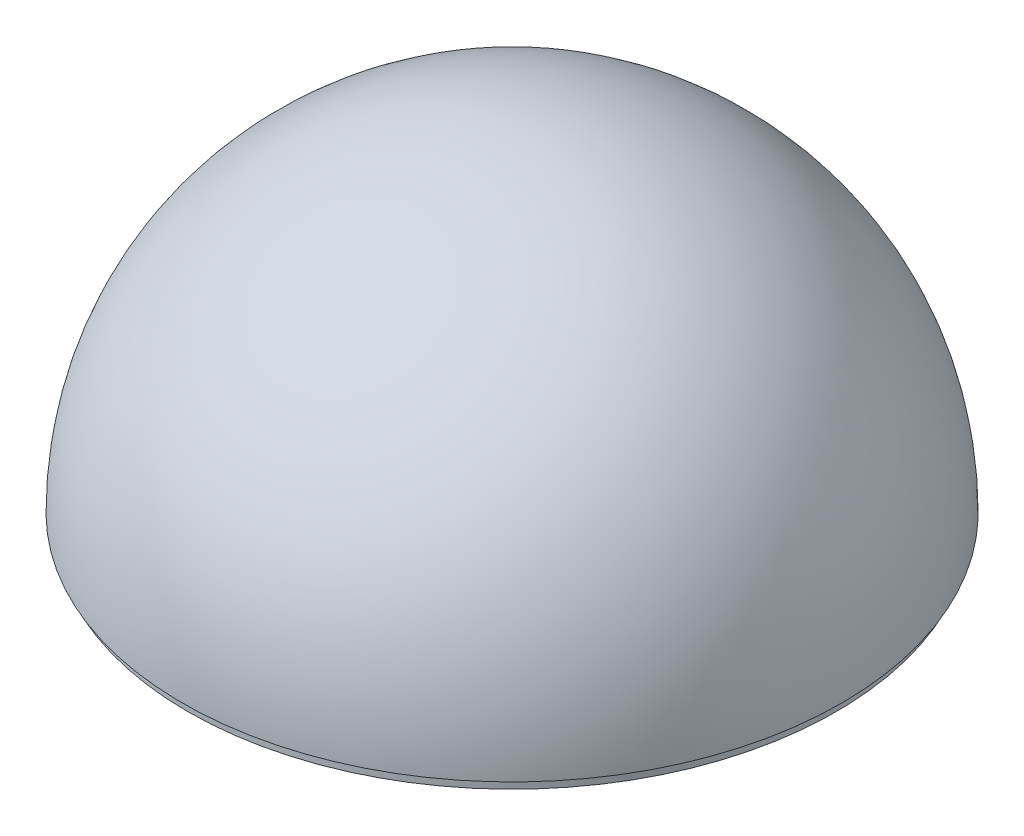
ISO-10303-21;
HEADER;
FILE_DESCRIPTION(('STEP AP214'),'2;1');
FILE_NAME('part.step','',(''),(''),'','','');
FILE_SCHEMA(('AUTOMOTIVE_DESIGN { 1 0 10303 214 1 1 1 1 }'));
ENDSEC;
DATA;
#1=APPLICATION_CONTEXT('core data for automotive mechanical design processes');
#2=APPLICATION_PROTOCOL_DEFINITION('international standard','automotive_design',2000,#1);
#3=PRODUCT_CONTEXT('',#1,'mechanical');
#4=PRODUCT('Part','Part','',(#3));
#5=PRODUCT_RELATED_PRODUCT_CATEGORY('part','',(#4));
#6=PRODUCT_DEFINITION_FORMATION('','',#4);
#7=PRODUCT_DEFINITION_CONTEXT('part definition',#1,'design');
#8=PRODUCT_DEFINITION('design','',#6,#7);
#9=PRODUCT_DEFINITION_SHAPE('','',#8);
#10=(LENGTH_UNIT() NAMED_UNIT(*) SI_UNIT(.MILLI.,.METRE.));
#11=(NAMED_UNIT(*) PLANE_ANGLE_UNIT() SI_UNIT($,.RADIAN.));
#12=(NAMED_UNIT(*) SI_UNIT($,.STERADIAN.) SOLID_ANGLE_UNIT());
#13=UNCERTAINTY_MEASURE_WITH_UNIT(LENGTH_MEASURE(1.E-05),#10,'distance_accuracy_value','');
#14=(GEOMETRIC_REPRESENTATION_CONTEXT(3) GLOBAL_UNCERTAINTY_ASSIGNED_CONTEXT((#13)) GLOBAL_UNIT_ASSIGNED_CONTEXT((#10,
#11,#12)) REPRESENTATION_CONTEXT('',''));
#15=CARTESIAN_POINT('',(0.,0.,0.));
#16=DIRECTION('',(0.,0.,1.));
#17=DIRECTION('',(1.,0.,0.));
#18=AXIS2_PLACEMENT_3D('',#15,#16,#17);
#19=CARTESIAN_POINT('',(0.,-4.7625,0.));
#20=DIRECTION('',(0.,1.,0.));
#21=DIRECTION('',(0.,0.,1.));
#22=AXIS2_PLACEMENT_3D('',#19,#20,#21);
#23=CYLINDRICAL_SURFACE('',#22,152.4);
#24=CARTESIAN_POINT('',(0.,-4.7625,0.));
#25=DIRECTION('',(0.,1.,0.));
#26=DIRECTION('',(0.,0.,1.));
#27=AXIS2_PLACEMENT_3D('',#24,#25,#26);
#28=CIRCLE('',#27,152.4);
#29=CARTESIAN_POINT('',(0.,-4.7625,152.4));
#30=VERTEX_POINT('',#29);
#31=EDGE_CURVE('E11',#30,#30,#28,.T.);
#32=CARTESIAN_POINT('',(0.,0.,0.));
#33=DIRECTION('',(0.,1.,0.));
#34=DIRECTION('',(0.,0.,1.));
#35=AXIS2_PLACEMENT_3D('',#32,#33,#34);
#36=CIRCLE('',#35,152.4);
#37=CARTESIAN_POINT('',(0.,0.,152.4));
#38=VERTEX_POINT('',#37);
#39=EDGE_CURVE('E44',#38,#38,#36,.T.);
#40=CARTESIAN_POINT('',(0.,-4.7625,152.4));
#41=CARTESIAN_POINT('',(0.,-4.712890625,152.4));
#42=CARTESIAN_POINT('',(0.,-4.66328125,152.4));
#43=CARTESIAN_POINT('',(0.,-4.5640625,152.4));
#44=CARTESIAN_POINT('',(0.,-4.514453125,152.4));
#45=CARTESIAN_POINT('',(0.,-4.415234375,152.4));
#46=CARTESIAN_POINT('',(0.,-4.365625,152.4));
#47=CARTESIAN_POINT('',(0.,-4.26640625,152.4));
#48=CARTESIAN_POINT('',(0.,-4.216796875,152.4));
#49=CARTESIAN_POINT('',(0.,-4.117578125,152.4));
#50=CARTESIAN_POINT('',(0.,-4.06796875,152.4));
#51=CARTESIAN_POINT('',(0.,-3.96875,152.4));
#52=CARTESIAN_POINT('',(0.,-3.919140625,152.4));
#53=CARTESIAN_POINT('',(0.,-3.819921875,152.4));
#54=CARTESIAN_POINT('',(0.,-3.7703125,152.4));
#55=CARTESIAN_POINT('',(0.,-3.67109375,152.4));
#56=CARTESIAN_POINT('',(0.,-3.621484375,152.4));
#57=CARTESIAN_POINT('',(0.,-3.522265625,152.4));
#58=CARTESIAN_POINT('',(0.,-3.47265625,152.4));
#59=CARTESIAN_POINT('',(0.,-3.3734375,152.4));
#60=CARTESIAN_POINT('',(0.,-3.323828125,152.4));
#61=CARTESIAN_POINT('',(0.,-3.224609375,152.4));
#62=CARTESIAN_POINT('',(0.,-3.175,152.4));
#63=CARTESIAN_POINT('',(0.,-3.07578125,152.4));
#64=CARTESIAN_POINT('',(0.,-3.026171875,152.4));
#65=CARTESIAN_POINT('',(0.,-2.926953125,152.4));
#66=CARTESIAN_POINT('',(0.,-2.87734375,152.4));
#67=CARTESIAN_POINT('',(0.,-2.778125,152.4));
#68=CARTESIAN_POINT('',(0.,-2.728515625,152.4));
#69=CARTESIAN_POINT('',(0.,-2.629296875,152.4));
#70=CARTESIAN_POINT('',(0.,-2.5796875,152.4));
#71=CARTESIAN_POINT('',(0.,-2.48046875,152.4));
#72=CARTESIAN_POINT('',(0.,-2.430859375,152.4));
#73=CARTESIAN_POINT('',(0.,-2.331640625,152.4));
#74=CARTESIAN_POINT('',(0.,-2.28203125,152.4));
#75=CARTESIAN_POINT('',(0.,-2.1828125,152.4));
#76=CARTESIAN_POINT('',(0.,-2.133203125,152.4));
#77=CARTESIAN_POINT('',(0.,-2.033984375,152.4));
#78=CARTESIAN_POINT('',(0.,-1.984375,152.4));
#79=CARTESIAN_POINT('',(0.,-1.88515625,152.4));
#80=CARTESIAN_POINT('',(0.,-1.835546875,152.4));
#81=CARTESIAN_POINT('',(0.,-1.736328125,152.4));
#82=CARTESIAN_POINT('',(0.,-1.68671875,152.4));
#83=CARTESIAN_POINT('',(0.,-1.5875,152.4));
#84=CARTESIAN_POINT('',(0.,-1.537890625,152.4));
#85=CARTESIAN_POINT('',(0.,-1.438671875,152.4));
#86=CARTESIAN_POINT('',(0.,-1.3890625,152.4));
#87=CARTESIAN_POINT('',(0.,-1.28984375,152.4));
#88=CARTESIAN_POINT('',(0.,-1.240234375,152.4));
#89=CARTESIAN_POINT('',(0.,-1.141015625,152.4));
#90=CARTESIAN_POINT('',(0.,-1.09140625,152.4));
#91=CARTESIAN_POINT('',(0.,-0.9921875,152.4));
#92=CARTESIAN_POINT('',(0.,-0.942578125,152.4));
#93=CARTESIAN_POINT('',(0.,-0.843359375,152.4));
#94=CARTESIAN_POINT('',(0.,-0.79375,152.4));
#95=CARTESIAN_POINT('',(0.,-0.69453125,152.4));
#96=CARTESIAN_POINT('',(0.,-0.644921875,152.4));
#97=CARTESIAN_POINT('',(0.,-0.545703125,152.4));
#98=CARTESIAN_POINT('',(0.,-0.49609375,152.4));
#99=CARTESIAN_POINT('',(0.,-0.396875,152.4));
#100=CARTESIAN_POINT('',(0.,-0.347265625,152.4));
#101=CARTESIAN_POINT('',(0.,-0.248046875,152.4));
#102=CARTESIAN_POINT('',(0.,-0.1984375,152.4));
#103=CARTESIAN_POINT('',(0.,-0.09921875,152.4));
#104=CARTESIAN_POINT('',(0.,-0.049609375,152.4));
#105=CARTESIAN_POINT('',(0.,0.,152.4));
#106=B_SPLINE_CURVE_WITH_KNOTS('',3,(#40,#41,#42,#43,#44,#45,#46,#47,#48,#49,#50,#51,#52,#53,
#54,#55,#56,#57,#58,#59,#60,#61,#62,#63,#64,#65,#66,#67,#68,#69,#70,#71,#72,#73,#74,#75,#76,#77,
#78,#79,#80,#81,#82,#83,#84,#85,#86,#87,#88,#89,#90,#91,#92,#93,#94,#95,#96,#97,#98,#99,#100,
#101,#102,#103,#104,#105),.UNSPECIFIED.,.F.,.F.,(4,2,2,2,2,2,2,2,2,2,2,2,2,2,2,2,2,2,2,2,2,2,2,
2,2,2,2,2,2,2,2,2,4),(0.,0.148828125,0.29765625,0.446484375,0.5953125,0.744140625,
0.892968750000001,1.041796875,1.190625,1.339453125,1.48828125,1.637109375,1.7859375,1.934765625,
2.08359375,2.232421875,2.38125,2.530078125,2.67890625,2.827734375,2.9765625,3.125390625,
3.27421875,3.423046875,3.571875,3.720703125,3.86953125,4.018359375,4.1671875,4.316015625,
4.46484375,4.613671875,4.7625),.UNSPECIFIED.);
#107=EDGE_CURVE('BSEAM41',#30,#38,#106,.T.);
#108=ORIENTED_EDGE('',*,*,#31,.T.);
#109=ORIENTED_EDGE('',*,*,#39,.F.);
#110=ORIENTED_EDGE('',*,*,#107,.T.);
#111=ORIENTED_EDGE('',*,*,#107,.F.);
#112=EDGE_LOOP('',(#108,#110,#109,#111));
#113=FACE_BOUND('',#112,.T.);
#114=ADVANCED_FACE('F41',(#113),#23,.T.);
#115=CARTESIAN_POINT('',(0.,-4.7625,0.));
#116=DIRECTION('',(0.,1.,0.));
#117=DIRECTION('',(0.,0.,1.));
#118=AXIS2_PLACEMENT_3D('',#115,#116,#117);
#119=PLANE('',#118);
#120=ORIENTED_EDGE('',*,*,#31,.F.);
#121=EDGE_LOOP('',(#120));
#122=FACE_BOUND('',#121,.T.);
#123=ADVANCED_FACE('F56',(#122),#119,.F.);
#124=CARTESIAN_POINT('',(0.,0.,0.));
#125=DIRECTION('',(0.,1.,0.));
#126=DIRECTION('',(0.,0.,1.));
#127=AXIS2_PLACEMENT_3D('',#124,#125,#126);
#128=PLANE('',#127);
#129=ORIENTED_EDGE('',*,*,#39,.T.);
#130=EDGE_LOOP('',(#129));
#131=FACE_BOUND('',#130,.T.);
#132=ADVANCED_FACE('F53',(#131),#128,.T.);
#133=CLOSED_SHELL('',(#114,#123,#132));
#134=MANIFOLD_SOLID_BREP('B2',#133);
#135=CARTESIAN_POINT('',(1.11981703314034E-13,0.,0.));
#136=DIRECTION('',(0.,0.,-1.));
#137=DIRECTION('',(-1.,0.,0.));
#138=AXIS2_PLACEMENT_3D('',#135,#136,#137);
#139=SPHERICAL_SURFACE('',#138,154.94);
#140=CARTESIAN_POINT('',(1.11981703314034E-13,0.,0.));
#141=DIRECTION('',(0.,-1.,0.));
#142=DIRECTION('',(1.,0.,0.));
#143=AXIS2_PLACEMENT_3D('',#140,#141,#142);
#144=SPHERICAL_SURFACE('',#143,154.94);
#145=CARTESIAN_POINT('',(1.11981703314034E-13,0.,0.));
#146=DIRECTION('',(0.,-1.,0.));
#147=DIRECTION('',(1.,0.,0.));
#148=AXIS2_PLACEMENT_3D('',#145,#146,#147);
#149=CIRCLE('',#148,154.94);
#150=CARTESIAN_POINT('',(154.94,1.08194023728071E-12,0.));
#151=VERTEX_POINT('',#150);
#152=EDGE_CURVE('E40',#151,#151,#149,.T.);
#153=ORIENTED_EDGE('',*,*,#152,.F.);
#154=EDGE_LOOP('',(#153));
#155=FACE_BOUND('',#154,.T.);
#156=ADVANCED_FACE('F82',(#155),#144,.T.);
#157=CARTESIAN_POINT('',(1.11981703314034E-13,0.,0.));
#158=DIRECTION('',(0.,-1.,0.));
#159=DIRECTION('',(0.,0.,1.));
#160=AXIS2_PLACEMENT_3D('',#157,#158,#159);
#161=PLANE('',#160);
#162=CARTESIAN_POINT('',(1.11981703314034E-13,0.,0.));
#163=DIRECTION('',(0.,-1.,0.));
#164=DIRECTION('',(0.,0.,1.));
#165=AXIS2_PLACEMENT_3D('',#162,#163,#164);
#166=CIRCLE('',#165,152.4);
#167=CARTESIAN_POINT('',(1.11981703314034E-13,0.,152.4));
#168=VERTEX_POINT('',#167);
#169=EDGE_CURVE('E88',#168,#168,#166,.T.);
#170=ORIENTED_EDGE('',*,*,#169,.F.);
#171=EDGE_LOOP('',(#170));
#172=FACE_BOUND('',#171,.T.);
#173=ORIENTED_EDGE('',*,*,#152,.T.);
#174=EDGE_LOOP('',(#173));
#175=FACE_BOUND('',#174,.T.);
#176=ADVANCED_FACE('F96',(#172,#175),#161,.T.);
#177=CARTESIAN_POINT('',(1.11981703314034E-13,0.,0.));
#178=DIRECTION('',(0.,0.,-1.));
#179=DIRECTION('',(-1.,0.,0.));
#180=AXIS2_PLACEMENT_3D('',#177,#178,#179);
#181=SPHERICAL_SURFACE('',#180,152.4);
#182=CARTESIAN_POINT('',(1.11981703314034E-13,0.,0.));
#183=DIRECTION('',(0.,-1.,0.));
#184=DIRECTION('',(0.,0.,1.));
#185=AXIS2_PLACEMENT_3D('',#182,#183,#184);
#186=SPHERICAL_SURFACE('',#185,152.4);
#187=ORIENTED_EDGE('',*,*,#169,.T.);
#188=EDGE_LOOP('',(#187));
#189=FACE_BOUND('',#188,.T.);
#190=ADVANCED_FACE('F94',(#189),#186,.F.);
#191=CLOSED_SHELL('',(#156,#176,#190));
#192=MANIFOLD_SOLID_BREP('B6',#191);
#193=ADVANCED_BREP_SHAPE_REPRESENTATION('',(#18,#134,#192),#14);
#194=SHAPE_DEFINITION_REPRESENTATION(#9,#193);
ENDSEC;
END-ISO-10303-21;
